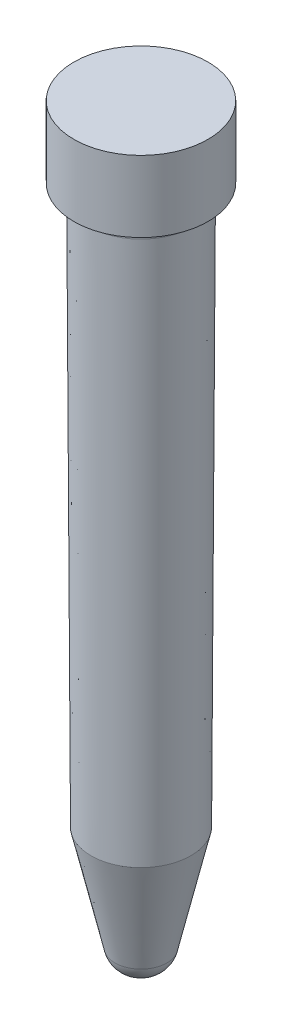
ISO-10303-21;
HEADER;
FILE_DESCRIPTION(('STEP AP214'),'2;1');
FILE_NAME('part.step','',(''),(''),'','','');
FILE_SCHEMA(('AUTOMOTIVE_DESIGN { 1 0 10303 214 1 1 1 1 }'));
ENDSEC;
DATA;
#1=APPLICATION_CONTEXT('core data for automotive mechanical design processes');
#2=APPLICATION_PROTOCOL_DEFINITION('international standard','automotive_design',2000,#1);
#3=PRODUCT_CONTEXT('',#1,'mechanical');
#4=PRODUCT('Part','Part','',(#3));
#5=PRODUCT_RELATED_PRODUCT_CATEGORY('part','',(#4));
#6=PRODUCT_DEFINITION_FORMATION('','',#4);
#7=PRODUCT_DEFINITION_CONTEXT('part definition',#1,'design');
#8=PRODUCT_DEFINITION('design','',#6,#7);
#9=PRODUCT_DEFINITION_SHAPE('','',#8);
#10=(LENGTH_UNIT() NAMED_UNIT(*) SI_UNIT(.MILLI.,.METRE.));
#11=(NAMED_UNIT(*) PLANE_ANGLE_UNIT() SI_UNIT($,.RADIAN.));
#12=(NAMED_UNIT(*) SI_UNIT($,.STERADIAN.) SOLID_ANGLE_UNIT());
#13=UNCERTAINTY_MEASURE_WITH_UNIT(LENGTH_MEASURE(1.E-05),#10,'distance_accuracy_value','');
#14=(GEOMETRIC_REPRESENTATION_CONTEXT(3) GLOBAL_UNCERTAINTY_ASSIGNED_CONTEXT((#13)) GLOBAL_UNIT_ASSIGNED_CONTEXT((#10,
#11,#12)) REPRESENTATION_CONTEXT('',''));
#15=CARTESIAN_POINT('',(0.,0.,0.));
#16=DIRECTION('',(0.,0.,1.));
#17=DIRECTION('',(1.,0.,0.));
#18=AXIS2_PLACEMENT_3D('',#15,#16,#17);
#19=CARTESIAN_POINT('',(0.,-117.925892814655,0.));
#20=DIRECTION('',(0.,1.,0.));
#21=DIRECTION('',(-1.,0.,0.));
#22=AXIS2_PLACEMENT_3D('',#19,#20,#21);
#23=PLANE('',#22);
#24=CARTESIAN_POINT('',(0.,-117.925892814655,0.));
#25=DIRECTION('',(0.,1.,0.));
#26=DIRECTION('',(-1.,0.,0.));
#27=AXIS2_PLACEMENT_3D('',#24,#25,#26);
#28=CIRCLE('',#27,0.309007936352796);
#29=CARTESIAN_POINT('',(-0.309007936352782,-117.925892814655,0.));
#30=VERTEX_POINT('',#29);
#31=EDGE_CURVE('E58',#30,#30,#28,.T.);
#32=ORIENTED_EDGE('',*,*,#31,.F.);
#33=EDGE_LOOP('',(#32));
#34=FACE_BOUND('',#33,.T.);
#35=ADVANCED_FACE('F38',(#34),#23,.F.);
#36=CARTESIAN_POINT('',(0.,-114.056407172561,0.));
#37=DIRECTION('',(0.,1.,0.));
#38=DIRECTION('',(-1.,0.,0.));
#39=AXIS2_PLACEMENT_3D('',#36,#37,#38);
#40=DEGENERATE_TOROIDAL_SURFACE('',#39,0.30900793635276,3.86948564209426,.T.);
#41=CARTESIAN_POINT('',(0.,-114.916598227941,0.));
#42=DIRECTION('',(0.,1.,0.));
#43=DIRECTION('',(-1.,0.,0.));
#44=AXIS2_PLACEMENT_3D('',#41,#42,#43);
#45=CIRCLE('',#44,4.08167151565818);
#46=CARTESIAN_POINT('',(-4.08167151565816,-114.916598227941,0.));
#47=VERTEX_POINT('',#46);
#48=EDGE_CURVE('E85',#47,#47,#45,.T.);
#49=ORIENTED_EDGE('',*,*,#48,.F.);
#50=EDGE_LOOP('',(#49));
#51=FACE_BOUND('',#50,.T.);
#52=ORIENTED_EDGE('',*,*,#31,.T.);
#53=EDGE_LOOP('',(#52));
#54=FACE_BOUND('',#53,.T.);
#55=ADVANCED_FACE('F132',(#51,#54),#40,.T.);
#56=CARTESIAN_POINT('',(0.,-98.4989443242871,0.));
#57=DIRECTION('',(0.,1.,0.));
#58=DIRECTION('',(-1.,0.,0.));
#59=AXIS2_PLACEMENT_3D('',#56,#57,#58);
#60=CONICAL_SURFACE('',#59,7.825,0.224174030957439);
#61=ORIENTED_EDGE('',*,*,#48,.T.);
#62=EDGE_LOOP('',(#61));
#63=FACE_BOUND('',#62,.T.);
#64=CARTESIAN_POINT('',(0.,-98.4989443242871,0.));
#65=DIRECTION('',(0.,1.,0.));
#66=DIRECTION('',(-1.,0.,0.));
#67=AXIS2_PLACEMENT_3D('',#64,#65,#66);
#68=CIRCLE('',#67,7.825);
#69=CARTESIAN_POINT('',(-7.825,-98.4989443242871,0.));
#70=VERTEX_POINT('',#69);
#71=EDGE_CURVE('E91',#70,#70,#68,.T.);
#72=ORIENTED_EDGE('',*,*,#71,.F.);
#73=EDGE_LOOP('',(#72));
#74=FACE_BOUND('',#73,.T.);
#75=ADVANCED_FACE('F138',(#63,#74),#60,.T.);
#76=CARTESIAN_POINT('',(0.,-12.95,0.));
#77=DIRECTION('',(0.,1.,0.));
#78=DIRECTION('',(-1.,0.,0.));
#79=AXIS2_PLACEMENT_3D('',#76,#77,#78);
#80=CONICAL_SURFACE('',#79,8.25,0.00496787548984923);
#81=ORIENTED_EDGE('',*,*,#71,.T.);
#82=EDGE_LOOP('',(#81));
#83=FACE_BOUND('',#82,.T.);
#84=CARTESIAN_POINT('',(0.,-12.95,0.));
#85=DIRECTION('',(0.,1.,0.));
#86=DIRECTION('',(-1.,0.,0.));
#87=AXIS2_PLACEMENT_3D('',#84,#85,#86);
#88=CIRCLE('',#87,8.25);
#89=CARTESIAN_POINT('',(-8.25000000000001,-12.95,0.));
#90=VERTEX_POINT('',#89);
#91=EDGE_CURVE('E97',#90,#90,#88,.T.);
#92=ORIENTED_EDGE('',*,*,#91,.F.);
#93=EDGE_LOOP('',(#92));
#94=FACE_BOUND('',#93,.T.);
#95=ADVANCED_FACE('F258',(#83,#94),#80,.T.);
#96=CARTESIAN_POINT('',(0.,0.,0.));
#97=DIRECTION('',(0.,1.,0.));
#98=DIRECTION('',(-1.,0.,0.));
#99=AXIS2_PLACEMENT_3D('',#96,#97,#98);
#100=CYLINDRICAL_SURFACE('',#99,8.25);
#101=ORIENTED_EDGE('',*,*,#91,.T.);
#102=EDGE_LOOP('',(#101));
#103=FACE_BOUND('',#102,.T.);
#104=CARTESIAN_POINT('',(0.,-11.1499999999998,0.));
#105=DIRECTION('',(0.,1.,0.));
#106=DIRECTION('',(-1.,0.,0.));
#107=AXIS2_PLACEMENT_3D('',#104,#105,#106);
#108=CIRCLE('',#107,8.25);
#109=CARTESIAN_POINT('',(-8.25,-11.1499999999998,0.));
#110=VERTEX_POINT('',#109);
#111=EDGE_CURVE('E103',#110,#110,#108,.T.);
#112=ORIENTED_EDGE('',*,*,#111,.F.);
#113=EDGE_LOOP('',(#112));
#114=FACE_BOUND('',#113,.T.);
#115=ADVANCED_FACE('F128',(#103,#114),#100,.T.);
#116=CARTESIAN_POINT('',(0.,-11.1499999999997,0.));
#117=DIRECTION('',(0.,-1.,0.));
#118=DIRECTION('',(1.,0.,0.));
#119=AXIS2_PLACEMENT_3D('',#116,#117,#118);
#120=PLANE('',#119);
#121=ORIENTED_EDGE('',*,*,#111,.T.);
#122=EDGE_LOOP('',(#121));
#123=FACE_BOUND('',#122,.T.);
#124=CARTESIAN_POINT('',(0.,-11.1499999999997,0.));
#125=DIRECTION('',(0.,1.,0.));
#126=DIRECTION('',(-1.,0.,0.));
#127=AXIS2_PLACEMENT_3D('',#124,#125,#126);
#128=CIRCLE('',#127,10.5);
#129=CARTESIAN_POINT('',(-10.5,-11.1499999999997,0.));
#130=VERTEX_POINT('',#129);
#131=EDGE_CURVE('E107',#130,#130,#128,.T.);
#132=ORIENTED_EDGE('',*,*,#131,.F.);
#133=EDGE_LOOP('',(#132));
#134=FACE_BOUND('',#133,.T.);
#135=ADVANCED_FACE('F120',(#123,#134),#120,.T.);
#136=CARTESIAN_POINT('',(0.,0.,0.));
#137=DIRECTION('',(0.,1.,0.));
#138=DIRECTION('',(-1.,0.,0.));
#139=AXIS2_PLACEMENT_3D('',#136,#137,#138);
#140=CYLINDRICAL_SURFACE('',#139,10.5);
#141=ORIENTED_EDGE('',*,*,#131,.T.);
#142=EDGE_LOOP('',(#141));
#143=FACE_BOUND('',#142,.T.);
#144=CARTESIAN_POINT('',(0.,0.,0.));
#145=DIRECTION('',(0.,1.,0.));
#146=DIRECTION('',(-1.,0.,0.));
#147=AXIS2_PLACEMENT_3D('',#144,#145,#146);
#148=CIRCLE('',#147,10.5);
#149=CARTESIAN_POINT('',(-10.5,0.,0.));
#150=VERTEX_POINT('',#149);
#151=EDGE_CURVE('E111',#150,#150,#148,.T.);
#152=ORIENTED_EDGE('',*,*,#151,.F.);
#153=EDGE_LOOP('',(#152));
#154=FACE_BOUND('',#153,.T.);
#155=ADVANCED_FACE('F118',(#143,#154),#140,.T.);
#156=CARTESIAN_POINT('',(0.,0.,0.));
#157=DIRECTION('',(0.,1.,0.));
#158=DIRECTION('',(-1.,0.,0.));
#159=AXIS2_PLACEMENT_3D('',#156,#157,#158);
#160=PLANE('',#159);
#161=ORIENTED_EDGE('',*,*,#151,.T.);
#162=EDGE_LOOP('',(#161));
#163=FACE_BOUND('',#162,.T.);
#164=ADVANCED_FACE('F116',(#163),#160,.T.);
#165=CLOSED_SHELL('',(#35,#55,#75,#95,#115,#135,#155,#164));
#166=CARTESIAN_POINT('',(0.,-116.925892814655,0.));
#167=DIRECTION('',(0.,1.,0.));
#168=DIRECTION('',(-1.,0.,0.));
#169=AXIS2_PLACEMENT_3D('',#166,#167,#168);
#170=PLANE('',#169);
#171=CARTESIAN_POINT('',(0.,-116.925892814655,0.));
#172=DIRECTION('',(0.,1.,0.));
#173=DIRECTION('',(-1.,0.,0.));
#174=AXIS2_PLACEMENT_3D('',#171,#172,#173);
#175=CIRCLE('',#174,0.309007936352792);
#176=CARTESIAN_POINT('',(-0.309007936352787,-116.925892814655,0.));
#177=VERTEX_POINT('',#176);
#178=EDGE_CURVE('E42',#177,#177,#175,.T.);
#179=ORIENTED_EDGE('',*,*,#178,.T.);
#180=EDGE_LOOP('',(#179));
#181=FACE_BOUND('',#180,.T.);
#182=ADVANCED_FACE('F143',(#181),#170,.T.);
#183=CARTESIAN_POINT('',(0.,-114.056407172561,0.));
#184=DIRECTION('',(0.,1.,0.));
#185=DIRECTION('',(-1.,0.,0.));
#186=AXIS2_PLACEMENT_3D('',#183,#184,#185);
#187=DEGENERATE_TOROIDAL_SURFACE('',#186,0.30900793635276,2.86948564209426,.T.);
#188=CARTESIAN_POINT('',(0.,-114.694297091577,0.));
#189=DIRECTION('',(0.,1.,0.));
#190=DIRECTION('',(-1.,0.,0.));
#191=AXIS2_PLACEMENT_3D('',#188,#189,#190);
#192=CIRCLE('',#191,3.10669346217624);
#193=CARTESIAN_POINT('',(-3.10669346217623,-114.694297091577,0.));
#194=VERTEX_POINT('',#193);
#195=EDGE_CURVE('E71',#194,#194,#192,.T.);
#196=ORIENTED_EDGE('',*,*,#195,.T.);
#197=EDGE_LOOP('',(#196));
#198=FACE_BOUND('',#197,.T.);
#199=ORIENTED_EDGE('',*,*,#178,.F.);
#200=EDGE_LOOP('',(#199));
#201=FACE_BOUND('',#200,.T.);
#202=ADVANCED_FACE('F146',(#198,#201),#187,.F.);
#203=CARTESIAN_POINT('',(0.,-98.2766431879235,0.));
#204=DIRECTION('',(0.,1.,0.));
#205=DIRECTION('',(-1.,0.,0.));
#206=AXIS2_PLACEMENT_3D('',#203,#204,#205);
#207=CONICAL_SURFACE('',#206,6.85002194651806,0.224174030957439);
#208=ORIENTED_EDGE('',*,*,#195,.F.);
#209=EDGE_LOOP('',(#208));
#210=FACE_BOUND('',#209,.T.);
#211=CARTESIAN_POINT('',(0.,-98.3839337490233,0.));
#212=DIRECTION('',(0.,1.,0.));
#213=DIRECTION('',(-1.,0.,0.));
#214=AXIS2_PLACEMENT_3D('',#211,#212,#213);
#215=CIRCLE('',#214,6.82555902289797);
#216=CARTESIAN_POINT('',(-6.82555902289797,-98.3839337490233,0.));
#217=VERTEX_POINT('',#216);
#218=EDGE_CURVE('E68',#217,#217,#215,.T.);
#219=ORIENTED_EDGE('',*,*,#218,.T.);
#220=EDGE_LOOP('',(#219));
#221=FACE_BOUND('',#220,.T.);
#222=ADVANCED_FACE('F150',(#210,#221),#207,.F.);
#223=CARTESIAN_POINT('',(0.,-12.9450321449445,0.));
#224=DIRECTION('',(0.,1.,0.));
#225=DIRECTION('',(-1.,0.,0.));
#226=AXIS2_PLACEMENT_3D('',#223,#224,#225);
#227=CONICAL_SURFACE('',#226,7.25001233986806,0.00496787548984923);
#228=ORIENTED_EDGE('',*,*,#218,.F.);
#229=EDGE_LOOP('',(#228));
#230=FACE_BOUND('',#229,.T.);
#231=CARTESIAN_POINT('',(0.,-12.9475160571464,0.));
#232=DIRECTION('',(0.,1.,0.));
#233=DIRECTION('',(-1.,0.,0.));
#234=AXIS2_PLACEMENT_3D('',#231,#232,#233);
#235=CIRCLE('',#234,7.25);
#236=CARTESIAN_POINT('',(-7.25000000000001,-12.9475160571464,0.));
#237=VERTEX_POINT('',#236);
#238=EDGE_CURVE('E64',#237,#237,#235,.T.);
#239=ORIENTED_EDGE('',*,*,#238,.T.);
#240=EDGE_LOOP('',(#239));
#241=FACE_BOUND('',#240,.T.);
#242=ADVANCED_FACE('F153',(#230,#241),#227,.F.);
#243=CARTESIAN_POINT('',(0.,0.,0.));
#244=DIRECTION('',(0.,1.,0.));
#245=DIRECTION('',(-1.,0.,0.));
#246=AXIS2_PLACEMENT_3D('',#243,#244,#245);
#247=CYLINDRICAL_SURFACE('',#246,7.25);
#248=ORIENTED_EDGE('',*,*,#238,.F.);
#249=EDGE_LOOP('',(#248));
#250=FACE_BOUND('',#249,.T.);
#251=CARTESIAN_POINT('',(0.,-10.1499999999997,0.));
#252=DIRECTION('',(0.,-1.,0.));
#253=DIRECTION('',(1.,0.,0.));
#254=AXIS2_PLACEMENT_3D('',#251,#252,#253);
#255=CIRCLE('',#254,7.25);
#256=CARTESIAN_POINT('',(7.25,-10.1499999999997,0.));
#257=VERTEX_POINT('',#256);
#258=EDGE_CURVE('E55',#257,#257,#255,.F.);
#259=ORIENTED_EDGE('',*,*,#258,.T.);
#260=EDGE_LOOP('',(#259));
#261=FACE_BOUND('',#260,.T.);
#262=ADVANCED_FACE('F157',(#250,#261),#247,.F.);
#263=CARTESIAN_POINT('',(0.,-10.1499999999997,0.));
#264=DIRECTION('',(0.,-1.,0.));
#265=DIRECTION('',(1.,0.,0.));
#266=AXIS2_PLACEMENT_3D('',#263,#264,#265);
#267=PLANE('',#266);
#268=ORIENTED_EDGE('',*,*,#258,.F.);
#269=EDGE_LOOP('',(#268));
#270=FACE_BOUND('',#269,.T.);
#271=CARTESIAN_POINT('',(0.,-10.1499999999997,0.));
#272=DIRECTION('',(0.,-1.,0.));
#273=DIRECTION('',(1.,0.,0.));
#274=AXIS2_PLACEMENT_3D('',#271,#272,#273);
#275=CIRCLE('',#274,9.50000000000004);
#276=CARTESIAN_POINT('',(9.50000000000004,-10.1499999999997,0.));
#277=VERTEX_POINT('',#276);
#278=EDGE_CURVE('E48',#277,#277,#275,.F.);
#279=ORIENTED_EDGE('',*,*,#278,.T.);
#280=EDGE_LOOP('',(#279));
#281=FACE_BOUND('',#280,.T.);
#282=ADVANCED_FACE('F161',(#270,#281),#267,.F.);
#283=CARTESIAN_POINT('',(0.,0.,0.));
#284=DIRECTION('',(0.,1.,0.));
#285=DIRECTION('',(-1.,0.,0.));
#286=AXIS2_PLACEMENT_3D('',#283,#284,#285);
#287=CYLINDRICAL_SURFACE('',#286,9.50000000000004);
#288=ORIENTED_EDGE('',*,*,#278,.F.);
#289=EDGE_LOOP('',(#288));
#290=FACE_BOUND('',#289,.T.);
#291=CARTESIAN_POINT('',(0.,-1.,0.));
#292=DIRECTION('',(0.,1.,0.));
#293=DIRECTION('',(-1.,0.,0.));
#294=AXIS2_PLACEMENT_3D('',#291,#292,#293);
#295=CIRCLE('',#294,9.50000000000004);
#296=CARTESIAN_POINT('',(-9.50000000000004,-1.,0.));
#297=VERTEX_POINT('',#296);
#298=EDGE_CURVE('E10',#297,#297,#295,.T.);
#299=ORIENTED_EDGE('',*,*,#298,.T.);
#300=EDGE_LOOP('',(#299));
#301=FACE_BOUND('',#300,.T.);
#302=ADVANCED_FACE('F164',(#290,#301),#287,.F.);
#303=CARTESIAN_POINT('',(0.,-1.,0.));
#304=DIRECTION('',(0.,1.,0.));
#305=DIRECTION('',(-1.,0.,0.));
#306=AXIS2_PLACEMENT_3D('',#303,#304,#305);
#307=PLANE('',#306);
#308=ORIENTED_EDGE('',*,*,#298,.F.);
#309=EDGE_LOOP('',(#308));
#310=FACE_BOUND('',#309,.T.);
#311=ADVANCED_FACE('F40',(#310),#307,.F.);
#312=CLOSED_SHELL('',(#182,#202,#222,#242,#262,#282,#302,#311));
#313=ORIENTED_CLOSED_SHELL('',*,#312,.T.);
#314=BREP_WITH_VOIDS('B2',#165,(#313));
#315=ADVANCED_BREP_SHAPE_REPRESENTATION('',(#18,#314),#14);
#316=SHAPE_DEFINITION_REPRESENTATION(#9,#315);
ENDSEC;
END-ISO-10303-21;
